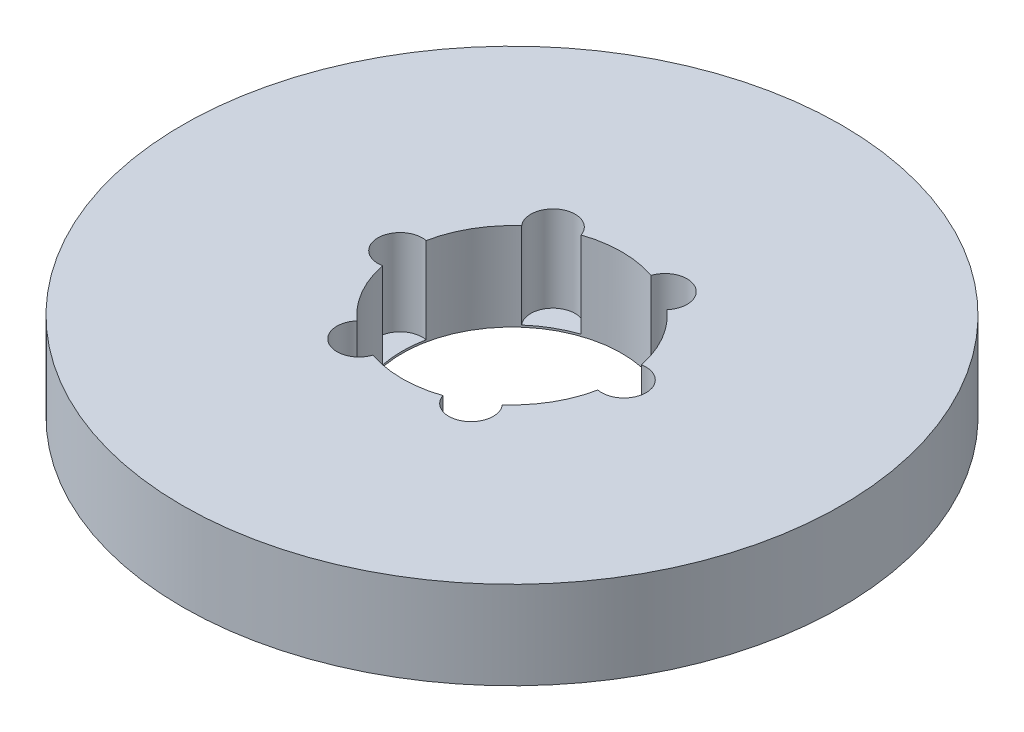
ISO-10303-21;
HEADER;
FILE_DESCRIPTION(('STEP AP214'),'2;1');
FILE_NAME('part.step','',(''),(''),'','','');
FILE_SCHEMA(('AUTOMOTIVE_DESIGN { 1 0 10303 214 1 1 1 1 }'));
ENDSEC;
DATA;
#1=APPLICATION_CONTEXT('core data for automotive mechanical design processes');
#2=APPLICATION_PROTOCOL_DEFINITION('international standard','automotive_design',2000,#1);
#3=PRODUCT_CONTEXT('',#1,'mechanical');
#4=PRODUCT('Part','Part','',(#3));
#5=PRODUCT_RELATED_PRODUCT_CATEGORY('part','',(#4));
#6=PRODUCT_DEFINITION_FORMATION('','',#4);
#7=PRODUCT_DEFINITION_CONTEXT('part definition',#1,'design');
#8=PRODUCT_DEFINITION('design','',#6,#7);
#9=PRODUCT_DEFINITION_SHAPE('','',#8);
#10=(LENGTH_UNIT() NAMED_UNIT(*) SI_UNIT(.MILLI.,.METRE.));
#11=(NAMED_UNIT(*) PLANE_ANGLE_UNIT() SI_UNIT($,.RADIAN.));
#12=(NAMED_UNIT(*) SI_UNIT($,.STERADIAN.) SOLID_ANGLE_UNIT());
#13=UNCERTAINTY_MEASURE_WITH_UNIT(LENGTH_MEASURE(1.E-05),#10,'distance_accuracy_value','');
#14=(GEOMETRIC_REPRESENTATION_CONTEXT(3) GLOBAL_UNCERTAINTY_ASSIGNED_CONTEXT((#13)) GLOBAL_UNIT_ASSIGNED_CONTEXT((#10,
#11,#12)) REPRESENTATION_CONTEXT('',''));
#15=CARTESIAN_POINT('',(0.,0.,0.));
#16=DIRECTION('',(0.,0.,1.));
#17=DIRECTION('',(1.,0.,0.));
#18=AXIS2_PLACEMENT_3D('',#15,#16,#17);
#19=CARTESIAN_POINT('',(0.,6.,0.));
#20=DIRECTION('',(0.,-1.,0.));
#21=DIRECTION('',(0.,0.,-1.));
#22=AXIS2_PLACEMENT_3D('',#19,#20,#21);
#23=CYLINDRICAL_SURFACE('',#22,22.5);
#24=CARTESIAN_POINT('',(0.,6.,0.));
#25=DIRECTION('',(0.,1.,0.));
#26=DIRECTION('',(0.,0.,1.));
#27=AXIS2_PLACEMENT_3D('',#24,#25,#26);
#28=CIRCLE('',#27,22.5);
#29=CARTESIAN_POINT('',(0.,6.,22.5));
#30=VERTEX_POINT('',#29);
#31=EDGE_CURVE('E171',#30,#30,#28,.T.);
#32=ORIENTED_EDGE('',*,*,#31,.F.);
#33=EDGE_LOOP('',(#32));
#34=FACE_BOUND('',#33,.T.);
#35=CARTESIAN_POINT('',(0.,0.,0.));
#36=DIRECTION('',(0.,1.,0.));
#37=DIRECTION('',(0.,0.,1.));
#38=AXIS2_PLACEMENT_3D('',#35,#36,#37);
#39=CIRCLE('',#38,22.5);
#40=CARTESIAN_POINT('',(0.,0.,22.5));
#41=VERTEX_POINT('',#40);
#42=EDGE_CURVE('E157',#41,#41,#39,.T.);
#43=ORIENTED_EDGE('',*,*,#42,.T.);
#44=EDGE_LOOP('',(#43));
#45=FACE_BOUND('',#44,.T.);
#46=ADVANCED_FACE('F39',(#34,#45),#23,.T.);
#47=CARTESIAN_POINT('',(0.,6.,0.));
#48=DIRECTION('',(0.,1.,0.));
#49=DIRECTION('',(0.,0.,1.));
#50=AXIS2_PLACEMENT_3D('',#47,#48,#49);
#51=PLANE('',#50);
#52=CARTESIAN_POINT('',(-3.82051088784928,6.,-6.61731896862486));
#53=DIRECTION('',(0.,1.,0.));
#54=DIRECTION('',(-0.866025403784433,0.,0.50000000000001));
#55=AXIS2_PLACEMENT_3D('',#52,#53,#54);
#56=CIRCLE('',#55,1.51531106351426);
#57=CARTESIAN_POINT('',(-2.38747837315845,6.,-7.10984859316291));
#58=VERTEX_POINT('',#57);
#59=CARTESIAN_POINT('',(-4.96357031216104,6.,-5.6225412187225));
#60=VERTEX_POINT('',#59);
#61=EDGE_CURVE('E214',#58,#60,#56,.T.);
#62=ORIENTED_EDGE('',*,*,#61,.F.);
#63=CARTESIAN_POINT('',(0.,6.,0.));
#64=DIRECTION('',(0.,1.,0.));
#65=DIRECTION('',(0.,0.,1.));
#66=AXIS2_PLACEMENT_3D('',#63,#64,#65);
#67=CIRCLE('',#66,7.5);
#68=CARTESIAN_POINT('',(2.3874783731583,6.,-7.10984859316296));
#69=VERTEX_POINT('',#68);
#70=EDGE_CURVE('E272',#69,#58,#67,.T.);
#71=ORIENTED_EDGE('',*,*,#70,.F.);
#72=CARTESIAN_POINT('',(3.82051088784914,6.,-6.61731896862494));
#73=DIRECTION('',(0.,1.,0.));
#74=DIRECTION('',(-0.866025403784443,0.,-0.499999999999992));
#75=AXIS2_PLACEMENT_3D('',#72,#73,#74);
#76=CIRCLE('',#75,1.51531106351426);
#77=CARTESIAN_POINT('',(4.96357031216092,6.,-5.62254121872261));
#78=VERTEX_POINT('',#77);
#79=EDGE_CURVE('E285',#78,#69,#76,.T.);
#80=ORIENTED_EDGE('',*,*,#79,.F.);
#81=CARTESIAN_POINT('',(7.35104868531934,6.,-1.48730737444038));
#82=VERTEX_POINT('',#81);
#83=EDGE_CURVE('E165',#82,#78,#67,.T.);
#84=ORIENTED_EDGE('',*,*,#83,.F.);
#85=CARTESIAN_POINT('',(7.64102177569841,6.,0.));
#86=DIRECTION('',(0.,1.,0.));
#87=DIRECTION('',(0.,0.,-1.));
#88=AXIS2_PLACEMENT_3D('',#85,#86,#87);
#89=CIRCLE('',#88,1.51531106351426);
#90=CARTESIAN_POINT('',(7.35104868531934,6.,1.48730737444038));
#91=VERTEX_POINT('',#90);
#92=EDGE_CURVE('E281',#91,#82,#89,.T.);
#93=ORIENTED_EDGE('',*,*,#92,.F.);
#94=CARTESIAN_POINT('',(4.963570312161,6.,5.62254121872254));
#95=VERTEX_POINT('',#94);
#96=EDGE_CURVE('E160',#95,#91,#67,.T.);
#97=ORIENTED_EDGE('',*,*,#96,.F.);
#98=CARTESIAN_POINT('',(3.82051088784924,6.,6.61731896862489));
#99=DIRECTION('',(0.,1.,0.));
#100=DIRECTION('',(0.866025403784436,0.,-0.500000000000004));
#101=AXIS2_PLACEMENT_3D('',#98,#99,#100);
#102=CIRCLE('',#101,1.51531106351426);
#103=CARTESIAN_POINT('',(2.3874783731584,6.,7.10984859316293));
#104=VERTEX_POINT('',#103);
#105=EDGE_CURVE('E154',#104,#95,#102,.T.);
#106=ORIENTED_EDGE('',*,*,#105,.F.);
#107=CARTESIAN_POINT('',(-2.38747837315835,6.,7.10984859316295));
#108=VERTEX_POINT('',#107);
#109=EDGE_CURVE('E150',#108,#104,#67,.T.);
#110=ORIENTED_EDGE('',*,*,#109,.F.);
#111=CARTESIAN_POINT('',(-3.82051088784919,6.,6.61731896862492));
#112=DIRECTION('',(0.,1.,0.));
#113=DIRECTION('',(0.86602540378444,0.,0.499999999999998));
#114=AXIS2_PLACEMENT_3D('',#111,#112,#113);
#115=CIRCLE('',#114,1.51531106351426);
#116=CARTESIAN_POINT('',(-4.96357031216096,6.,5.62254121872257));
#117=VERTEX_POINT('',#116);
#118=EDGE_CURVE('E127',#117,#108,#115,.T.);
#119=ORIENTED_EDGE('',*,*,#118,.F.);
#120=CARTESIAN_POINT('',(-7.35104868531934,6.,1.48730737444038));
#121=VERTEX_POINT('',#120);
#122=EDGE_CURVE('E156',#121,#117,#67,.T.);
#123=ORIENTED_EDGE('',*,*,#122,.F.);
#124=CARTESIAN_POINT('',(-7.64102177569841,6.,0.));
#125=DIRECTION('',(0.,1.,0.));
#126=DIRECTION('',(0.,0.,1.));
#127=AXIS2_PLACEMENT_3D('',#124,#125,#126);
#128=CIRCLE('',#127,1.51531106351426);
#129=CARTESIAN_POINT('',(-7.35104868531934,6.,-1.48730737444038));
#130=VERTEX_POINT('',#129);
#131=EDGE_CURVE('E164',#130,#121,#128,.T.);
#132=ORIENTED_EDGE('',*,*,#131,.F.);
#133=EDGE_CURVE('E159',#60,#130,#67,.T.);
#134=ORIENTED_EDGE('',*,*,#133,.F.);
#135=EDGE_LOOP('',(#62,#71,#80,#84,#93,#97,#106,#110,#119,#123,#132,#134));
#136=FACE_BOUND('',#135,.T.);
#137=ORIENTED_EDGE('',*,*,#31,.T.);
#138=EDGE_LOOP('',(#137));
#139=FACE_BOUND('',#138,.T.);
#140=ADVANCED_FACE('F155',(#136,#139),#51,.T.);
#141=CARTESIAN_POINT('',(0.,0.,0.));
#142=DIRECTION('',(0.,1.,0.));
#143=DIRECTION('',(0.,0.,1.));
#144=AXIS2_PLACEMENT_3D('',#141,#142,#143);
#145=PLANE('',#144);
#146=CARTESIAN_POINT('',(0.,0.,0.));
#147=DIRECTION('',(0.,1.,0.));
#148=DIRECTION('',(0.,0.,1.));
#149=AXIS2_PLACEMENT_3D('',#146,#147,#148);
#150=CIRCLE('',#149,7.5);
#151=CARTESIAN_POINT('',(0.,0.,7.5));
#152=VERTEX_POINT('',#151);
#153=EDGE_CURVE('E170',#152,#152,#150,.T.);
#154=ORIENTED_EDGE('',*,*,#153,.T.);
#155=EDGE_LOOP('',(#154));
#156=FACE_BOUND('',#155,.T.);
#157=ORIENTED_EDGE('',*,*,#42,.F.);
#158=EDGE_LOOP('',(#157));
#159=FACE_BOUND('',#158,.T.);
#160=ADVANCED_FACE('F232',(#156,#159),#145,.F.);
#161=CARTESIAN_POINT('',(0.,6.,0.));
#162=DIRECTION('',(0.,-1.,0.));
#163=DIRECTION('',(0.,0.,-1.));
#164=AXIS2_PLACEMENT_3D('',#161,#162,#163);
#165=CYLINDRICAL_SURFACE('',#164,7.5);
#166=DIRECTION('',(0.,1.,0.));
#167=VECTOR('',#166,1.);
#168=CARTESIAN_POINT('',(-2.38747837315845,3.06486829426789,-7.10984859316291));
#169=LINE('',#168,#167);
#170=CARTESIAN_POINT('',(-2.38747837315845,0.129736588535789,-7.10984859316291));
#171=VERTEX_POINT('',#170);
#172=EDGE_CURVE('E11',#171,#58,#169,.T.);
#173=ORIENTED_EDGE('',*,*,#172,.F.);
#174=CARTESIAN_POINT('',(0.,0.129736588535789,0.));
#175=DIRECTION('',(0.,1.,0.));
#176=DIRECTION('',(0.,0.,1.));
#177=AXIS2_PLACEMENT_3D('',#174,#175,#176);
#178=CIRCLE('',#177,7.5);
#179=CARTESIAN_POINT('',(-4.96357031216104,0.129736588535789,-5.6225412187225));
#180=VERTEX_POINT('',#179);
#181=EDGE_CURVE('E209',#171,#180,#178,.T.);
#182=ORIENTED_EDGE('',*,*,#181,.T.);
#183=DIRECTION('',(0.,1.,0.));
#184=VECTOR('',#183,1.);
#185=CARTESIAN_POINT('',(-4.96357031216104,3.06486829426789,-5.62254121872251));
#186=LINE('',#185,#184);
#187=EDGE_CURVE('E46',#60,#180,#186,.F.);
#188=ORIENTED_EDGE('',*,*,#187,.F.);
#189=ORIENTED_EDGE('',*,*,#133,.T.);
#190=DIRECTION('',(0.,1.,0.));
#191=VECTOR('',#190,1.);
#192=CARTESIAN_POINT('',(-7.35104868531934,3.06486829426789,-1.48730737444038));
#193=LINE('',#192,#191);
#194=CARTESIAN_POINT('',(-7.35104868531934,0.129736588535789,-1.48730737444038));
#195=VERTEX_POINT('',#194);
#196=EDGE_CURVE('E185',#195,#130,#193,.T.);
#197=ORIENTED_EDGE('',*,*,#196,.F.);
#198=CARTESIAN_POINT('',(0.,0.129736588535789,0.));
#199=DIRECTION('',(0.,1.,0.));
#200=DIRECTION('',(0.,0.,1.));
#201=AXIS2_PLACEMENT_3D('',#198,#199,#200);
#202=CIRCLE('',#201,7.5);
#203=CARTESIAN_POINT('',(-7.35104868531934,0.129736588535789,1.48730737444038));
#204=VERTEX_POINT('',#203);
#205=EDGE_CURVE('E173',#195,#204,#202,.T.);
#206=ORIENTED_EDGE('',*,*,#205,.T.);
#207=DIRECTION('',(0.,1.,0.));
#208=VECTOR('',#207,1.);
#209=CARTESIAN_POINT('',(-7.35104868531934,3.06486829426789,1.48730737444038));
#210=LINE('',#209,#208);
#211=EDGE_CURVE('E178',#121,#204,#210,.F.);
#212=ORIENTED_EDGE('',*,*,#211,.F.);
#213=ORIENTED_EDGE('',*,*,#122,.T.);
#214=DIRECTION('',(0.,1.,0.));
#215=VECTOR('',#214,1.);
#216=CARTESIAN_POINT('',(-4.96357031216096,3.06486829426789,5.62254121872257));
#217=LINE('',#216,#215);
#218=CARTESIAN_POINT('',(-4.96357031216096,0.129736588535789,5.62254121872257));
#219=VERTEX_POINT('',#218);
#220=EDGE_CURVE('E132',#219,#117,#217,.T.);
#221=ORIENTED_EDGE('',*,*,#220,.F.);
#222=CARTESIAN_POINT('',(0.,0.129736588535789,0.));
#223=DIRECTION('',(0.,1.,0.));
#224=DIRECTION('',(0.,0.,1.));
#225=AXIS2_PLACEMENT_3D('',#222,#223,#224);
#226=CIRCLE('',#225,7.5);
#227=CARTESIAN_POINT('',(-2.38747837315835,0.129736588535789,7.10984859316295));
#228=VERTEX_POINT('',#227);
#229=EDGE_CURVE('E146',#219,#228,#226,.T.);
#230=ORIENTED_EDGE('',*,*,#229,.T.);
#231=DIRECTION('',(0.,1.,0.));
#232=VECTOR('',#231,1.);
#233=CARTESIAN_POINT('',(-2.38747837315835,3.06486829426789,7.10984859316295));
#234=LINE('',#233,#232);
#235=EDGE_CURVE('E128',#108,#228,#234,.F.);
#236=ORIENTED_EDGE('',*,*,#235,.F.);
#237=ORIENTED_EDGE('',*,*,#109,.T.);
#238=DIRECTION('',(0.,1.,0.));
#239=VECTOR('',#238,1.);
#240=CARTESIAN_POINT('',(2.3874783731584,3.06486829426789,7.10984859316293));
#241=LINE('',#240,#239);
#242=CARTESIAN_POINT('',(2.3874783731584,0.129736588535789,7.10984859316293));
#243=VERTEX_POINT('',#242);
#244=EDGE_CURVE('E192',#243,#104,#241,.T.);
#245=ORIENTED_EDGE('',*,*,#244,.F.);
#246=CARTESIAN_POINT('',(0.,0.129736588535789,0.));
#247=DIRECTION('',(0.,1.,0.));
#248=DIRECTION('',(0.,0.,1.));
#249=AXIS2_PLACEMENT_3D('',#246,#247,#248);
#250=CIRCLE('',#249,7.5);
#251=CARTESIAN_POINT('',(4.963570312161,0.129736588535789,5.62254121872254));
#252=VERTEX_POINT('',#251);
#253=EDGE_CURVE('E190',#243,#252,#250,.T.);
#254=ORIENTED_EDGE('',*,*,#253,.T.);
#255=DIRECTION('',(0.,1.,0.));
#256=VECTOR('',#255,1.);
#257=CARTESIAN_POINT('',(4.963570312161,3.06486829426789,5.62254121872254));
#258=LINE('',#257,#256);
#259=EDGE_CURVE('E189',#95,#252,#258,.F.);
#260=ORIENTED_EDGE('',*,*,#259,.F.);
#261=ORIENTED_EDGE('',*,*,#96,.T.);
#262=DIRECTION('',(0.,1.,0.));
#263=VECTOR('',#262,1.);
#264=CARTESIAN_POINT('',(7.35104868531934,3.06486829426789,1.48730737444038));
#265=LINE('',#264,#263);
#266=CARTESIAN_POINT('',(7.35104868531934,0.129736588535789,1.48730737444038));
#267=VERTEX_POINT('',#266);
#268=EDGE_CURVE('E203',#267,#91,#265,.T.);
#269=ORIENTED_EDGE('',*,*,#268,.F.);
#270=CARTESIAN_POINT('',(0.,0.129736588535789,0.));
#271=DIRECTION('',(0.,1.,0.));
#272=DIRECTION('',(0.,0.,1.));
#273=AXIS2_PLACEMENT_3D('',#270,#271,#272);
#274=CIRCLE('',#273,7.5);
#275=CARTESIAN_POINT('',(7.35104868531934,0.129736588535789,-1.48730737444038));
#276=VERTEX_POINT('',#275);
#277=EDGE_CURVE('E194',#267,#276,#274,.T.);
#278=ORIENTED_EDGE('',*,*,#277,.T.);
#279=DIRECTION('',(0.,1.,0.));
#280=VECTOR('',#279,1.);
#281=CARTESIAN_POINT('',(7.35104868531934,3.06486829426789,-1.48730737444038));
#282=LINE('',#281,#280);
#283=EDGE_CURVE('E196',#82,#276,#282,.F.);
#284=ORIENTED_EDGE('',*,*,#283,.F.);
#285=ORIENTED_EDGE('',*,*,#83,.T.);
#286=DIRECTION('',(0.,1.,0.));
#287=VECTOR('',#286,1.);
#288=CARTESIAN_POINT('',(4.96357031216092,3.06486829426789,-5.62254121872261));
#289=LINE('',#288,#287);
#290=CARTESIAN_POINT('',(4.96357031216092,0.129736588535789,-5.62254121872261));
#291=VERTEX_POINT('',#290);
#292=EDGE_CURVE('E208',#291,#78,#289,.T.);
#293=ORIENTED_EDGE('',*,*,#292,.F.);
#294=CARTESIAN_POINT('',(0.,0.129736588535789,0.));
#295=DIRECTION('',(0.,1.,0.));
#296=DIRECTION('',(0.,0.,1.));
#297=AXIS2_PLACEMENT_3D('',#294,#295,#296);
#298=CIRCLE('',#297,7.5);
#299=CARTESIAN_POINT('',(2.3874783731583,0.129736588535789,-7.10984859316296));
#300=VERTEX_POINT('',#299);
#301=EDGE_CURVE('E201',#291,#300,#298,.T.);
#302=ORIENTED_EDGE('',*,*,#301,.T.);
#303=DIRECTION('',(0.,1.,0.));
#304=VECTOR('',#303,1.);
#305=CARTESIAN_POINT('',(2.3874783731583,3.06486829426789,-7.10984859316296));
#306=LINE('',#305,#304);
#307=EDGE_CURVE('E206',#69,#300,#306,.F.);
#308=ORIENTED_EDGE('',*,*,#307,.F.);
#309=ORIENTED_EDGE('',*,*,#70,.T.);
#310=EDGE_LOOP('',(#173,#182,#188,#189,#197,#206,#212,#213,#221,#230,#236,#237,#245,#254,#260,
#261,#269,#278,#284,#285,#293,#302,#308,#309));
#311=FACE_BOUND('',#310,.T.);
#312=ORIENTED_EDGE('',*,*,#153,.F.);
#313=EDGE_LOOP('',(#312));
#314=FACE_BOUND('',#313,.T.);
#315=ADVANCED_FACE('F145',(#311,#314),#165,.F.);
#316=CARTESIAN_POINT('',(-7.64102177569841,0.129736588535789,0.));
#317=DIRECTION('',(0.,1.,0.));
#318=DIRECTION('',(0.,0.,1.));
#319=AXIS2_PLACEMENT_3D('',#316,#317,#318);
#320=CYLINDRICAL_SURFACE('',#319,1.51531106351426);
#321=ORIENTED_EDGE('',*,*,#196,.T.);
#322=ORIENTED_EDGE('',*,*,#131,.T.);
#323=ORIENTED_EDGE('',*,*,#211,.T.);
#324=CARTESIAN_POINT('',(-7.64102177569841,0.129736588535789,0.));
#325=DIRECTION('',(0.,1.,0.));
#326=DIRECTION('',(0.,0.,1.));
#327=AXIS2_PLACEMENT_3D('',#324,#325,#326);
#328=CIRCLE('',#327,1.51531106351426);
#329=EDGE_CURVE('E168',#195,#204,#328,.T.);
#330=ORIENTED_EDGE('',*,*,#329,.F.);
#331=EDGE_LOOP('',(#321,#322,#323,#330));
#332=FACE_BOUND('',#331,.T.);
#333=ADVANCED_FACE('F243',(#332),#320,.F.);
#334=CARTESIAN_POINT('',(-7.64102177569841,0.129736588535789,0.));
#335=DIRECTION('',(0.,1.,0.));
#336=DIRECTION('',(0.,0.,1.));
#337=AXIS2_PLACEMENT_3D('',#334,#335,#336);
#338=PLANE('',#337);
#339=ORIENTED_EDGE('',*,*,#329,.T.);
#340=ORIENTED_EDGE('',*,*,#205,.F.);
#341=EDGE_LOOP('',(#339,#340));
#342=FACE_BOUND('',#341,.T.);
#343=ADVANCED_FACE('F247',(#342),#338,.T.);
#344=CARTESIAN_POINT('',(-3.82051088784919,0.129736588535789,6.61731896862492));
#345=DIRECTION('',(0.,1.,0.));
#346=DIRECTION('',(0.,0.,1.));
#347=AXIS2_PLACEMENT_3D('',#344,#345,#346);
#348=CYLINDRICAL_SURFACE('',#347,1.51531106351426);
#349=ORIENTED_EDGE('',*,*,#220,.T.);
#350=ORIENTED_EDGE('',*,*,#118,.T.);
#351=ORIENTED_EDGE('',*,*,#235,.T.);
#352=CARTESIAN_POINT('',(-3.82051088784919,0.129736588535789,6.61731896862492));
#353=DIRECTION('',(0.,1.,0.));
#354=DIRECTION('',(0.86602540378444,0.,0.499999999999998));
#355=AXIS2_PLACEMENT_3D('',#352,#353,#354);
#356=CIRCLE('',#355,1.51531106351426);
#357=EDGE_CURVE('E137',#219,#228,#356,.T.);
#358=ORIENTED_EDGE('',*,*,#357,.F.);
#359=EDGE_LOOP('',(#349,#350,#351,#358));
#360=FACE_BOUND('',#359,.T.);
#361=ADVANCED_FACE('F126',(#360),#348,.F.);
#362=CARTESIAN_POINT('',(-3.82051088784919,0.129736588535789,6.61731896862492));
#363=DIRECTION('',(0.,1.,0.));
#364=DIRECTION('',(0.86602540378444,0.,0.499999999999998));
#365=AXIS2_PLACEMENT_3D('',#362,#363,#364);
#366=PLANE('',#365);
#367=ORIENTED_EDGE('',*,*,#357,.T.);
#368=ORIENTED_EDGE('',*,*,#229,.F.);
#369=EDGE_LOOP('',(#367,#368));
#370=FACE_BOUND('',#369,.T.);
#371=ADVANCED_FACE('F254',(#370),#366,.T.);
#372=CARTESIAN_POINT('',(3.82051088784924,0.129736588535789,6.61731896862489));
#373=DIRECTION('',(0.,1.,0.));
#374=DIRECTION('',(0.,0.,1.));
#375=AXIS2_PLACEMENT_3D('',#372,#373,#374);
#376=CYLINDRICAL_SURFACE('',#375,1.51531106351426);
#377=ORIENTED_EDGE('',*,*,#244,.T.);
#378=ORIENTED_EDGE('',*,*,#105,.T.);
#379=ORIENTED_EDGE('',*,*,#259,.T.);
#380=CARTESIAN_POINT('',(3.82051088784924,0.129736588535789,6.61731896862489));
#381=DIRECTION('',(0.,1.,0.));
#382=DIRECTION('',(0.866025403784436,0.,-0.500000000000004));
#383=AXIS2_PLACEMENT_3D('',#380,#381,#382);
#384=CIRCLE('',#383,1.51531106351426);
#385=EDGE_CURVE('E138',#243,#252,#384,.T.);
#386=ORIENTED_EDGE('',*,*,#385,.F.);
#387=EDGE_LOOP('',(#377,#378,#379,#386));
#388=FACE_BOUND('',#387,.T.);
#389=ADVANCED_FACE('F260',(#388),#376,.F.);
#390=CARTESIAN_POINT('',(3.82051088784924,0.129736588535789,6.61731896862489));
#391=DIRECTION('',(0.,1.,0.));
#392=DIRECTION('',(0.866025403784436,0.,-0.500000000000004));
#393=AXIS2_PLACEMENT_3D('',#390,#391,#392);
#394=PLANE('',#393);
#395=ORIENTED_EDGE('',*,*,#385,.T.);
#396=ORIENTED_EDGE('',*,*,#253,.F.);
#397=EDGE_LOOP('',(#395,#396));
#398=FACE_BOUND('',#397,.T.);
#399=ADVANCED_FACE('F265',(#398),#394,.T.);
#400=CARTESIAN_POINT('',(7.64102177569841,0.129736588535789,0.));
#401=DIRECTION('',(0.,1.,0.));
#402=DIRECTION('',(0.,0.,1.));
#403=AXIS2_PLACEMENT_3D('',#400,#401,#402);
#404=CYLINDRICAL_SURFACE('',#403,1.51531106351426);
#405=ORIENTED_EDGE('',*,*,#268,.T.);
#406=ORIENTED_EDGE('',*,*,#92,.T.);
#407=ORIENTED_EDGE('',*,*,#283,.T.);
#408=CARTESIAN_POINT('',(7.64102177569841,0.129736588535789,0.));
#409=DIRECTION('',(0.,1.,0.));
#410=DIRECTION('',(0.,0.,-1.));
#411=AXIS2_PLACEMENT_3D('',#408,#409,#410);
#412=CIRCLE('',#411,1.51531106351426);
#413=EDGE_CURVE('E287',#267,#276,#412,.T.);
#414=ORIENTED_EDGE('',*,*,#413,.F.);
#415=EDGE_LOOP('',(#405,#406,#407,#414));
#416=FACE_BOUND('',#415,.T.);
#417=ADVANCED_FACE('F300',(#416),#404,.F.);
#418=CARTESIAN_POINT('',(7.64102177569841,0.129736588535789,0.));
#419=DIRECTION('',(0.,1.,0.));
#420=DIRECTION('',(0.,0.,-1.));
#421=AXIS2_PLACEMENT_3D('',#418,#419,#420);
#422=PLANE('',#421);
#423=ORIENTED_EDGE('',*,*,#413,.T.);
#424=ORIENTED_EDGE('',*,*,#277,.F.);
#425=EDGE_LOOP('',(#423,#424));
#426=FACE_BOUND('',#425,.T.);
#427=ADVANCED_FACE('F298',(#426),#422,.T.);
#428=CARTESIAN_POINT('',(3.82051088784914,0.129736588535789,-6.61731896862494));
#429=DIRECTION('',(0.,1.,0.));
#430=DIRECTION('',(0.,0.,1.));
#431=AXIS2_PLACEMENT_3D('',#428,#429,#430);
#432=CYLINDRICAL_SURFACE('',#431,1.51531106351426);
#433=ORIENTED_EDGE('',*,*,#292,.T.);
#434=ORIENTED_EDGE('',*,*,#79,.T.);
#435=ORIENTED_EDGE('',*,*,#307,.T.);
#436=CARTESIAN_POINT('',(3.82051088784914,0.129736588535789,-6.61731896862494));
#437=DIRECTION('',(0.,1.,0.));
#438=DIRECTION('',(-0.866025403784443,0.,-0.499999999999992));
#439=AXIS2_PLACEMENT_3D('',#436,#437,#438);
#440=CIRCLE('',#439,1.51531106351426);
#441=EDGE_CURVE('E56',#291,#300,#440,.T.);
#442=ORIENTED_EDGE('',*,*,#441,.F.);
#443=EDGE_LOOP('',(#433,#434,#435,#442));
#444=FACE_BOUND('',#443,.T.);
#445=ADVANCED_FACE('F301',(#444),#432,.F.);
#446=CARTESIAN_POINT('',(3.82051088784914,0.129736588535789,-6.61731896862494));
#447=DIRECTION('',(0.,1.,0.));
#448=DIRECTION('',(-0.866025403784443,0.,-0.499999999999992));
#449=AXIS2_PLACEMENT_3D('',#446,#447,#448);
#450=PLANE('',#449);
#451=ORIENTED_EDGE('',*,*,#441,.T.);
#452=ORIENTED_EDGE('',*,*,#301,.F.);
#453=EDGE_LOOP('',(#451,#452));
#454=FACE_BOUND('',#453,.T.);
#455=ADVANCED_FACE('F221',(#454),#450,.T.);
#456=CARTESIAN_POINT('',(-3.82051088784928,0.129736588535789,-6.61731896862486));
#457=DIRECTION('',(0.,1.,0.));
#458=DIRECTION('',(0.,0.,1.));
#459=AXIS2_PLACEMENT_3D('',#456,#457,#458);
#460=CYLINDRICAL_SURFACE('',#459,1.51531106351426);
#461=ORIENTED_EDGE('',*,*,#172,.T.);
#462=ORIENTED_EDGE('',*,*,#61,.T.);
#463=ORIENTED_EDGE('',*,*,#187,.T.);
#464=CARTESIAN_POINT('',(-3.82051088784928,0.129736588535789,-6.61731896862486));
#465=DIRECTION('',(0.,1.,0.));
#466=DIRECTION('',(-0.866025403784433,0.,0.50000000000001));
#467=AXIS2_PLACEMENT_3D('',#464,#465,#466);
#468=CIRCLE('',#467,1.51531106351426);
#469=EDGE_CURVE('E55',#171,#180,#468,.T.);
#470=ORIENTED_EDGE('',*,*,#469,.F.);
#471=EDGE_LOOP('',(#461,#462,#463,#470));
#472=FACE_BOUND('',#471,.T.);
#473=ADVANCED_FACE('F212',(#472),#460,.F.);
#474=CARTESIAN_POINT('',(-3.82051088784928,0.129736588535789,-6.61731896862486));
#475=DIRECTION('',(0.,1.,0.));
#476=DIRECTION('',(-0.866025403784433,0.,0.50000000000001));
#477=AXIS2_PLACEMENT_3D('',#474,#475,#476);
#478=PLANE('',#477);
#479=ORIENTED_EDGE('',*,*,#469,.T.);
#480=ORIENTED_EDGE('',*,*,#181,.F.);
#481=EDGE_LOOP('',(#479,#480));
#482=FACE_BOUND('',#481,.T.);
#483=ADVANCED_FACE('F217',(#482),#478,.T.);
#484=CLOSED_SHELL('',(#46,#140,#160,#315,#333,#343,#361,#371,#389,#399,#417,#427,#445,#455,#473,#483));
#485=MANIFOLD_SOLID_BREP('B2',#484);
#486=ADVANCED_BREP_SHAPE_REPRESENTATION('',(#18,#485),#14);
#487=SHAPE_DEFINITION_REPRESENTATION(#9,#486);
ENDSEC;
END-ISO-10303-21;
